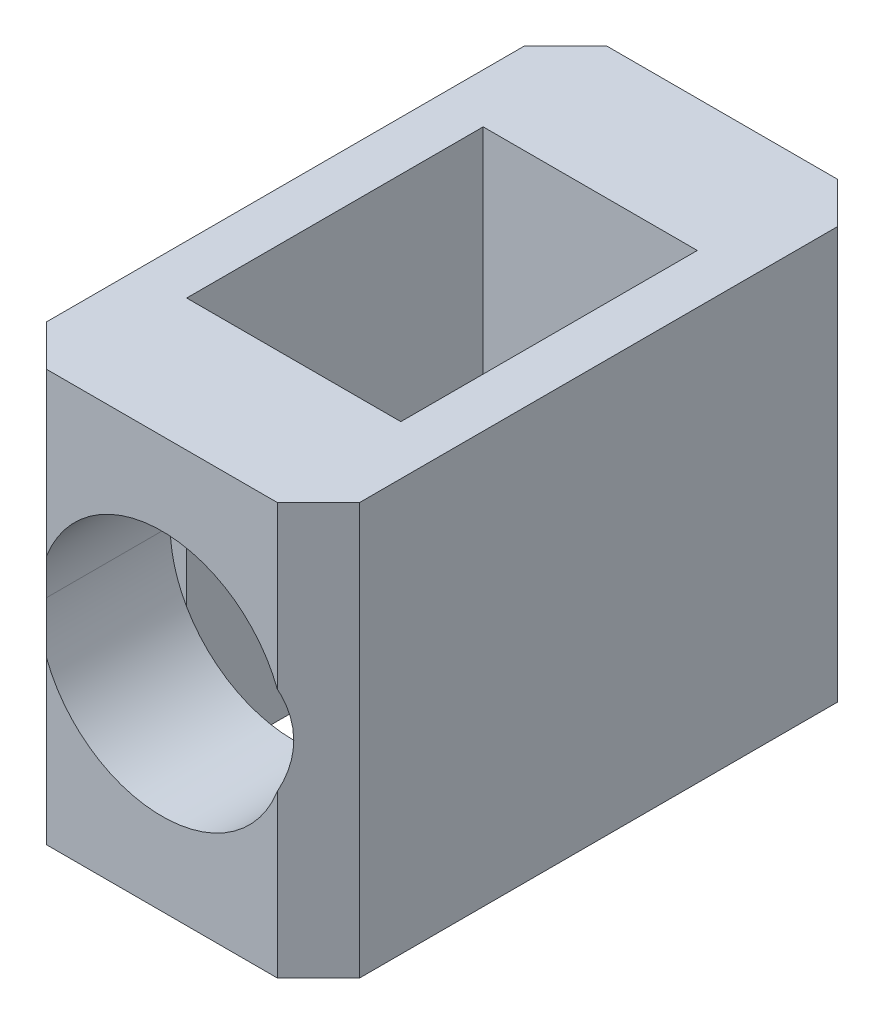
ISO-10303-21;
HEADER;
FILE_DESCRIPTION(('STEP AP214'),'2;1');
FILE_NAME('part.step','',(''),(''),'','','');
FILE_SCHEMA(('AUTOMOTIVE_DESIGN { 1 0 10303 214 1 1 1 1 }'));
ENDSEC;
DATA;
#1=APPLICATION_CONTEXT('core data for automotive mechanical design processes');
#2=APPLICATION_PROTOCOL_DEFINITION('international standard','automotive_design',2000,#1);
#3=PRODUCT_CONTEXT('',#1,'mechanical');
#4=PRODUCT('Part','Part','',(#3));
#5=PRODUCT_RELATED_PRODUCT_CATEGORY('part','',(#4));
#6=PRODUCT_DEFINITION_FORMATION('','',#4);
#7=PRODUCT_DEFINITION_CONTEXT('part definition',#1,'design');
#8=PRODUCT_DEFINITION('design','',#6,#7);
#9=PRODUCT_DEFINITION_SHAPE('','',#8);
#10=(LENGTH_UNIT() NAMED_UNIT(*) SI_UNIT(.MILLI.,.METRE.));
#11=(NAMED_UNIT(*) PLANE_ANGLE_UNIT() SI_UNIT($,.RADIAN.));
#12=(NAMED_UNIT(*) SI_UNIT($,.STERADIAN.) SOLID_ANGLE_UNIT());
#13=UNCERTAINTY_MEASURE_WITH_UNIT(LENGTH_MEASURE(1.E-05),#10,'distance_accuracy_value','');
#14=(GEOMETRIC_REPRESENTATION_CONTEXT(3) GLOBAL_UNCERTAINTY_ASSIGNED_CONTEXT((#13)) GLOBAL_UNIT_ASSIGNED_CONTEXT((#10,
#11,#12)) REPRESENTATION_CONTEXT('',''));
#15=CARTESIAN_POINT('',(0.,0.,0.));
#16=DIRECTION('',(0.,0.,1.));
#17=DIRECTION('',(1.,0.,0.));
#18=AXIS2_PLACEMENT_3D('',#15,#16,#17);
#19=CARTESIAN_POINT('',(2.53999999999975,5.27000000000021,8.43));
#20=DIRECTION('',(0.,0.,-1.));
#21=DIRECTION('',(-1.,0.,0.));
#22=AXIS2_PLACEMENT_3D('',#19,#20,#21);
#23=CYLINDRICAL_SURFACE('',#22,1.5);
#24=DIRECTION('',(0.,0.,1.));
#25=VECTOR('',#24,1.);
#26=CARTESIAN_POINT('',(1.04000000000035,5.26999999999963,8.43));
#27=LINE('',#26,#25);
#28=CARTESIAN_POINT('',(1.04000000000032,5.26999999999963,6.83));
#29=VERTEX_POINT('',#28);
#30=CARTESIAN_POINT('',(1.04000000000032,5.26999999999963,8.33));
#31=VERTEX_POINT('',#30);
#32=EDGE_CURVE('E250',#29,#31,#27,.T.);
#33=ORIENTED_EDGE('',*,*,#32,.F.);
#34=CARTESIAN_POINT('',(2.53999999999972,5.27000000000021,6.82999999999992));
#35=DIRECTION('',(0.,0.,1.));
#36=DIRECTION('',(-1.,0.,0.));
#37=AXIS2_PLACEMENT_3D('',#34,#35,#36);
#38=CIRCLE('',#37,1.5);
#39=CARTESIAN_POINT('',(1.24000000000002,6.01833147735468,6.83));
#40=VERTEX_POINT('',#39);
#41=EDGE_CURVE('E28',#40,#29,#38,.T.);
#42=ORIENTED_EDGE('',*,*,#41,.F.);
#43=CARTESIAN_POINT('',(2.53999999999972,5.27000000000021,6.83));
#44=DIRECTION('',(0.,0.,1.));
#45=DIRECTION('',(-1.,0.,0.));
#46=AXIS2_PLACEMENT_3D('',#43,#44,#45);
#47=CIRCLE('',#46,1.5);
#48=CARTESIAN_POINT('',(3.84000000000005,6.01833147735475,6.82999999999989));
#49=VERTEX_POINT('',#48);
#50=EDGE_CURVE('E304',#49,#40,#47,.T.);
#51=ORIENTED_EDGE('',*,*,#50,.F.);
#52=CARTESIAN_POINT('',(2.53999999999972,5.27000000000021,6.82999999999992));
#53=DIRECTION('',(0.,0.,1.));
#54=DIRECTION('',(-1.,0.,0.));
#55=AXIS2_PLACEMENT_3D('',#52,#53,#54);
#56=CIRCLE('',#55,1.5);
#57=CARTESIAN_POINT('',(4.03999999999983,5.27000000000007,6.82999999999989));
#58=VERTEX_POINT('',#57);
#59=EDGE_CURVE('E11',#58,#49,#56,.T.);
#60=ORIENTED_EDGE('',*,*,#59,.F.);
#61=DIRECTION('',(0.,0.,1.));
#62=VECTOR('',#61,1.);
#63=CARTESIAN_POINT('',(4.03999999999986,5.27000000000007,8.43));
#64=LINE('',#63,#62);
#65=CARTESIAN_POINT('',(4.03999999999983,5.27000000000007,8.32999999999989));
#66=VERTEX_POINT('',#65);
#67=EDGE_CURVE('E246',#58,#66,#64,.T.);
#68=ORIENTED_EDGE('',*,*,#67,.T.);
#69=CARTESIAN_POINT('',(2.53999999999975,5.27000000000021,9.83));
#70=DIRECTION('',(0.707106781186561,0.,0.707106781186534));
#71=DIRECTION('',(-0.707106781186534,0.,0.707106781186561));
#72=AXIS2_PLACEMENT_3D('',#69,#70,#71);
#73=ELLIPSE('',#72,2.12132034355964,1.5);
#74=CARTESIAN_POINT('',(3.93999999999981,5.80851648071365,8.43));
#75=VERTEX_POINT('',#74);
#76=EDGE_CURVE('E253',#66,#75,#73,.T.);
#77=ORIENTED_EDGE('',*,*,#76,.T.);
#78=CARTESIAN_POINT('',(2.53999999999975,5.27000000000021,8.43));
#79=DIRECTION('',(0.,0.,1.));
#80=DIRECTION('',(-1.,0.,0.));
#81=AXIS2_PLACEMENT_3D('',#78,#79,#80);
#82=CIRCLE('',#81,1.5);
#83=CARTESIAN_POINT('',(1.13999999999991,5.80851648071329,8.43));
#84=VERTEX_POINT('',#83);
#85=EDGE_CURVE('E299',#75,#84,#82,.T.);
#86=ORIENTED_EDGE('',*,*,#85,.T.);
#87=CARTESIAN_POINT('',(2.53999999999975,5.27000000000021,9.83));
#88=DIRECTION('',(-0.707106781186535,0.,0.70710678118656));
#89=DIRECTION('',(0.70710678118656,0.,0.707106781186535));
#90=AXIS2_PLACEMENT_3D('',#87,#88,#89);
#91=ELLIPSE('',#90,2.12132034355964,1.5);
#92=EDGE_CURVE('E21',#84,#31,#91,.T.);
#93=ORIENTED_EDGE('',*,*,#92,.T.);
#94=EDGE_LOOP('',(#33,#42,#51,#60,#68,#77,#86,#93));
#95=FACE_BOUND('',#94,.T.);
#96=ADVANCED_FACE('F17',(#95),#23,.F.);
#97=CARTESIAN_POINT('',(3.86500000000031,5.26999999999963,6.82999999999989));
#98=DIRECTION('',(0.,0.,1.));
#99=DIRECTION('',(1.,0.,0.));
#100=AXIS2_PLACEMENT_3D('',#97,#98,#99);
#101=PLANE('',#100);
#102=DIRECTION('',(0.,-1.,0.));
#103=VECTOR('',#102,1.);
#104=CARTESIAN_POINT('',(3.83999999999985,2.77000000000016,6.82999999999989));
#105=LINE('',#104,#103);
#106=CARTESIAN_POINT('',(3.84000000000005,4.52166852264494,6.82999999999989));
#107=VERTEX_POINT('',#106);
#108=EDGE_CURVE('E292',#49,#107,#105,.T.);
#109=ORIENTED_EDGE('',*,*,#108,.T.);
#110=CARTESIAN_POINT('',(2.53999999999972,5.27000000000021,6.82999999999992));
#111=DIRECTION('',(0.,0.,1.));
#112=DIRECTION('',(-1.,0.,0.));
#113=AXIS2_PLACEMENT_3D('',#110,#111,#112);
#114=CIRCLE('',#113,1.5);
#115=EDGE_CURVE('E249',#107,#58,#114,.T.);
#116=ORIENTED_EDGE('',*,*,#115,.T.);
#117=ORIENTED_EDGE('',*,*,#59,.T.);
#118=EDGE_LOOP('',(#109,#116,#117));
#119=FACE_BOUND('',#118,.T.);
#120=ADVANCED_FACE('F436',(#119),#101,.T.);
#121=CARTESIAN_POINT('',(3.86500000000031,5.26999999999963,6.82999999999989));
#122=DIRECTION('',(0.,0.,1.));
#123=DIRECTION('',(1.,0.,0.));
#124=AXIS2_PLACEMENT_3D('',#121,#122,#123);
#125=PLANE('',#124);
#126=CARTESIAN_POINT('',(2.53999999999972,5.27000000000021,6.82999999999992));
#127=DIRECTION('',(0.,0.,1.));
#128=DIRECTION('',(-1.,0.,0.));
#129=AXIS2_PLACEMENT_3D('',#126,#127,#128);
#130=CIRCLE('',#129,1.5);
#131=CARTESIAN_POINT('',(1.24000000000016,4.52166852264501,6.83));
#132=VERTEX_POINT('',#131);
#133=EDGE_CURVE('E235',#29,#132,#130,.T.);
#134=ORIENTED_EDGE('',*,*,#133,.T.);
#135=DIRECTION('',(0.,1.,0.));
#136=VECTOR('',#135,1.);
#137=CARTESIAN_POINT('',(1.23999999999988,2.77000000000016,6.83));
#138=LINE('',#137,#136);
#139=EDGE_CURVE('E262',#132,#40,#138,.T.);
#140=ORIENTED_EDGE('',*,*,#139,.T.);
#141=ORIENTED_EDGE('',*,*,#41,.T.);
#142=EDGE_LOOP('',(#134,#140,#141));
#143=FACE_BOUND('',#142,.T.);
#144=ADVANCED_FACE('F454',(#143),#125,.T.);
#145=CARTESIAN_POINT('',(2.53999999999975,5.27000000000021,8.43));
#146=DIRECTION('',(0.,0.,-1.));
#147=DIRECTION('',(-1.,0.,0.));
#148=AXIS2_PLACEMENT_3D('',#145,#146,#147);
#149=CYLINDRICAL_SURFACE('',#148,1.5);
#150=ORIENTED_EDGE('',*,*,#133,.F.);
#151=ORIENTED_EDGE('',*,*,#32,.T.);
#152=CARTESIAN_POINT('',(2.53999999999975,5.27000000000021,9.83));
#153=DIRECTION('',(-0.707106781186535,0.,0.70710678118656));
#154=DIRECTION('',(0.70710678118656,0.,0.707106781186535));
#155=AXIS2_PLACEMENT_3D('',#152,#153,#154);
#156=ELLIPSE('',#155,2.12132034355964,1.5);
#157=CARTESIAN_POINT('',(1.13999999999977,4.73148351928682,8.43));
#158=VERTEX_POINT('',#157);
#159=EDGE_CURVE('E163',#31,#158,#156,.T.);
#160=ORIENTED_EDGE('',*,*,#159,.T.);
#161=CARTESIAN_POINT('',(2.53999999999975,5.27000000000021,8.43));
#162=DIRECTION('',(0.,0.,1.));
#163=DIRECTION('',(-1.,0.,0.));
#164=AXIS2_PLACEMENT_3D('',#161,#162,#163);
#165=CIRCLE('',#164,1.5);
#166=CARTESIAN_POINT('',(3.94000000000015,4.73148351928624,8.43));
#167=VERTEX_POINT('',#166);
#168=EDGE_CURVE('E199',#158,#167,#165,.T.);
#169=ORIENTED_EDGE('',*,*,#168,.T.);
#170=CARTESIAN_POINT('',(2.53999999999975,5.27000000000021,9.83));
#171=DIRECTION('',(0.707106781186561,0.,0.707106781186534));
#172=DIRECTION('',(-0.707106781186534,0.,0.707106781186561));
#173=AXIS2_PLACEMENT_3D('',#170,#171,#172);
#174=ELLIPSE('',#173,2.12132034355964,1.5);
#175=EDGE_CURVE('E197',#167,#66,#174,.T.);
#176=ORIENTED_EDGE('',*,*,#175,.T.);
#177=ORIENTED_EDGE('',*,*,#67,.F.);
#178=ORIENTED_EDGE('',*,*,#115,.F.);
#179=CARTESIAN_POINT('',(2.53999999999972,5.27000000000021,6.83));
#180=DIRECTION('',(0.,0.,1.));
#181=DIRECTION('',(-1.,0.,0.));
#182=AXIS2_PLACEMENT_3D('',#179,#180,#181);
#183=CIRCLE('',#182,1.5);
#184=EDGE_CURVE('E231',#132,#107,#183,.T.);
#185=ORIENTED_EDGE('',*,*,#184,.F.);
#186=EDGE_LOOP('',(#150,#151,#160,#169,#176,#177,#178,#185));
#187=FACE_BOUND('',#186,.T.);
#188=ADVANCED_FACE('F452',(#187),#149,.F.);
#189=CARTESIAN_POINT('',(3.53999999999958,7.77000000000033,6.83));
#190=DIRECTION('',(0.,0.,1.));
#191=DIRECTION('',(1.,0.,0.));
#192=AXIS2_PLACEMENT_3D('',#189,#190,#191);
#193=PLANE('',#192);
#194=ORIENTED_EDGE('',*,*,#184,.T.);
#195=DIRECTION('',(0.,1.,0.));
#196=VECTOR('',#195,1.);
#197=CARTESIAN_POINT('',(3.83999999999985,2.77000000000016,6.83));
#198=LINE('',#197,#196);
#199=CARTESIAN_POINT('',(3.83999999999985,2.77000000000016,6.83));
#200=VERTEX_POINT('',#199);
#201=EDGE_CURVE('E223',#200,#107,#198,.T.);
#202=ORIENTED_EDGE('',*,*,#201,.F.);
#203=DIRECTION('',(1.,0.,0.));
#204=VECTOR('',#203,1.);
#205=CARTESIAN_POINT('',(60.4510968965142,2.7700000000002,6.82999999999898));
#206=LINE('',#205,#204);
#207=CARTESIAN_POINT('',(1.23999999999988,2.77000000000016,6.83));
#208=VERTEX_POINT('',#207);
#209=EDGE_CURVE('E317',#208,#200,#206,.T.);
#210=ORIENTED_EDGE('',*,*,#209,.F.);
#211=DIRECTION('',(0.,1.,0.));
#212=VECTOR('',#211,1.);
#213=CARTESIAN_POINT('',(1.23999999999988,2.77000000000016,6.83));
#214=LINE('',#213,#212);
#215=EDGE_CURVE('E258',#208,#132,#214,.T.);
#216=ORIENTED_EDGE('',*,*,#215,.T.);
#217=EDGE_LOOP('',(#194,#202,#210,#216));
#218=FACE_BOUND('',#217,.T.);
#219=ADVANCED_FACE('F448',(#218),#193,.F.);
#220=CARTESIAN_POINT('',(0.890000000000284,5.26999999999964,8.18));
#221=DIRECTION('',(-0.707106781186534,0.,0.707106781186561));
#222=DIRECTION('',(0.,1.,0.));
#223=AXIS2_PLACEMENT_3D('',#220,#221,#222);
#224=PLANE('',#223);
#225=DIRECTION('',(0.,1.,0.));
#226=VECTOR('',#225,1.);
#227=CARTESIAN_POINT('',(0.64,5.26999999999984,7.93));
#228=LINE('',#227,#226);
#229=CARTESIAN_POINT('',(0.639999999999773,2.77000000000016,7.93));
#230=VERTEX_POINT('',#229);
#231=CARTESIAN_POINT('',(0.640000000000284,7.76999999999961,7.93));
#232=VERTEX_POINT('',#231);
#233=EDGE_CURVE('E236',#230,#232,#228,.T.);
#234=ORIENTED_EDGE('',*,*,#233,.F.);
#235=DIRECTION('',(-0.70710678118656,0.,-0.707106781186535));
#236=VECTOR('',#235,1.);
#237=CARTESIAN_POINT('',(-62.080076808694,2.76999999999905,-54.7900768086914));
#238=LINE('',#237,#236);
#239=CARTESIAN_POINT('',(1.14000000000034,2.76999999999965,8.43));
#240=VERTEX_POINT('',#239);
#241=EDGE_CURVE('E183',#240,#230,#238,.T.);
#242=ORIENTED_EDGE('',*,*,#241,.F.);
#243=DIRECTION('',(0.,1.,0.));
#244=VECTOR('',#243,1.);
#245=CARTESIAN_POINT('',(1.13999999999983,5.27000000000006,8.43));
#246=LINE('',#245,#244);
#247=EDGE_CURVE('E190',#240,#158,#246,.T.);
#248=ORIENTED_EDGE('',*,*,#247,.T.);
#249=ORIENTED_EDGE('',*,*,#159,.F.);
#250=ORIENTED_EDGE('',*,*,#92,.F.);
#251=DIRECTION('',(0.,1.,0.));
#252=VECTOR('',#251,1.);
#253=CARTESIAN_POINT('',(1.13999999999983,5.27000000000006,8.43));
#254=LINE('',#253,#252);
#255=CARTESIAN_POINT('',(1.14000000000011,7.76999999999983,8.43));
#256=VERTEX_POINT('',#255);
#257=EDGE_CURVE('E184',#84,#256,#254,.T.);
#258=ORIENTED_EDGE('',*,*,#257,.T.);
#259=DIRECTION('',(-0.70710678118656,0.,-0.707106781186535));
#260=VECTOR('',#259,1.);
#261=CARTESIAN_POINT('',(-62.0800768086941,7.76999999999941,-54.7900768086914));
#262=LINE('',#261,#260);
#263=EDGE_CURVE('E267',#256,#232,#262,.T.);
#264=ORIENTED_EDGE('',*,*,#263,.T.);
#265=EDGE_LOOP('',(#234,#242,#248,#249,#250,#258,#264));
#266=FACE_BOUND('',#265,.T.);
#267=ADVANCED_FACE('F384',(#266),#224,.T.);
#268=CARTESIAN_POINT('',(4.18999999999987,5.27,8.18));
#269=DIRECTION('',(0.70710678118656,0.,0.707106781186535));
#270=DIRECTION('',(0.,-1.,0.));
#271=AXIS2_PLACEMENT_3D('',#268,#269,#270);
#272=PLANE('',#271);
#273=DIRECTION('',(0.,-1.,0.));
#274=VECTOR('',#273,1.);
#275=CARTESIAN_POINT('',(4.44000000000015,5.26999999999985,7.93));
#276=LINE('',#275,#274);
#277=CARTESIAN_POINT('',(4.43999999999967,7.77000000000023,7.93));
#278=VERTEX_POINT('',#277);
#279=CARTESIAN_POINT('',(4.43999999999987,2.77000000000009,7.93));
#280=VERTEX_POINT('',#279);
#281=EDGE_CURVE('E192',#278,#280,#276,.T.);
#282=ORIENTED_EDGE('',*,*,#281,.F.);
#283=DIRECTION('',(-0.707106781186534,0.,0.707106781186561));
#284=VECTOR('',#283,1.);
#285=CARTESIAN_POINT('',(67.1600768086914,7.77000000000049,-54.7900768086937));
#286=LINE('',#285,#284);
#287=CARTESIAN_POINT('',(3.93999999999987,7.77,8.43));
#288=VERTEX_POINT('',#287);
#289=EDGE_CURVE('E278',#278,#288,#286,.T.);
#290=ORIENTED_EDGE('',*,*,#289,.T.);
#291=DIRECTION('',(0.,-1.,0.));
#292=VECTOR('',#291,1.);
#293=CARTESIAN_POINT('',(3.94000000000035,5.26999999999964,8.43));
#294=LINE('',#293,#292);
#295=EDGE_CURVE('E303',#288,#75,#294,.T.);
#296=ORIENTED_EDGE('',*,*,#295,.T.);
#297=ORIENTED_EDGE('',*,*,#76,.F.);
#298=ORIENTED_EDGE('',*,*,#175,.F.);
#299=DIRECTION('',(0.,-1.,0.));
#300=VECTOR('',#299,1.);
#301=CARTESIAN_POINT('',(3.94000000000035,5.26999999999964,8.43));
#302=LINE('',#301,#300);
#303=CARTESIAN_POINT('',(3.9400000000001,2.76999999999987,8.43));
#304=VERTEX_POINT('',#303);
#305=EDGE_CURVE('E189',#167,#304,#302,.T.);
#306=ORIENTED_EDGE('',*,*,#305,.T.);
#307=DIRECTION('',(-0.707106781186534,0.,0.707106781186561));
#308=VECTOR('',#307,1.);
#309=CARTESIAN_POINT('',(67.1600768086915,2.77000000000048,-54.7900768086937));
#310=LINE('',#309,#308);
#311=EDGE_CURVE('E171',#280,#304,#310,.T.);
#312=ORIENTED_EDGE('',*,*,#311,.F.);
#313=EDGE_LOOP('',(#282,#290,#296,#297,#298,#306,#312));
#314=FACE_BOUND('',#313,.T.);
#315=ADVANCED_FACE('F194',(#314),#272,.T.);
#316=CARTESIAN_POINT('',(0.890000000000171,5.26999999999964,1.87999999999996));
#317=DIRECTION('',(-0.70710678118656,0.,-0.707106781186535));
#318=DIRECTION('',(-0.707106781186535,0.,0.70710678118656));
#319=AXIS2_PLACEMENT_3D('',#316,#317,#318);
#320=PLANE('',#319);
#321=DIRECTION('',(0.,-1.,0.));
#322=VECTOR('',#321,1.);
#323=CARTESIAN_POINT('',(0.639999999999915,5.26999999999984,2.12999999999996));
#324=LINE('',#323,#322);
#325=CARTESIAN_POINT('',(0.640000000000199,7.76999999999961,2.13000000000006));
#326=VERTEX_POINT('',#325);
#327=CARTESIAN_POINT('',(0.639999999999687,2.77000000000016,2.13000000000006));
#328=VERTEX_POINT('',#327);
#329=EDGE_CURVE('E214',#326,#328,#324,.T.);
#330=ORIENTED_EDGE('',*,*,#329,.F.);
#331=DIRECTION('',(0.707106781186534,0.,-0.707106781186561));
#332=VECTOR('',#331,1.);
#333=CARTESIAN_POINT('',(57.5600768086915,7.77000000000034,-54.7900768086936));
#334=LINE('',#333,#332);
#335=CARTESIAN_POINT('',(1.13999999999997,7.76999999999983,1.63000000000004));
#336=VERTEX_POINT('',#335);
#337=EDGE_CURVE('E263',#326,#336,#334,.T.);
#338=ORIENTED_EDGE('',*,*,#337,.T.);
#339=DIRECTION('',(0.,-1.,0.));
#340=VECTOR('',#339,1.);
#341=CARTESIAN_POINT('',(1.13999999999969,5.27000000000006,1.62999999999994));
#342=LINE('',#341,#340);
#343=CARTESIAN_POINT('',(1.1400000000002,2.76999999999965,1.63000000000004));
#344=VERTEX_POINT('',#343);
#345=EDGE_CURVE('E272',#336,#344,#342,.T.);
#346=ORIENTED_EDGE('',*,*,#345,.T.);
#347=DIRECTION('',(0.707106781186534,0.,-0.707106781186561));
#348=VECTOR('',#347,1.);
#349=CARTESIAN_POINT('',(57.5600768086917,2.77000000000019,-54.7900768086936));
#350=LINE('',#349,#348);
#351=EDGE_CURVE('E341',#328,#344,#350,.T.);
#352=ORIENTED_EDGE('',*,*,#351,.F.);
#353=EDGE_LOOP('',(#330,#338,#346,#352));
#354=FACE_BOUND('',#353,.T.);
#355=ADVANCED_FACE('F399',(#354),#320,.T.);
#356=CARTESIAN_POINT('',(4.18999999999976,5.27,1.87999999999989));
#357=DIRECTION('',(0.707106781186535,0.,-0.707106781186561));
#358=DIRECTION('',(0.,-1.,0.));
#359=AXIS2_PLACEMENT_3D('',#356,#357,#358);
#360=PLANE('',#359);
#361=DIRECTION('',(0.,-1.,0.));
#362=VECTOR('',#361,1.);
#363=CARTESIAN_POINT('',(3.94000000000021,5.26999999999964,1.6299999999999));
#364=LINE('',#363,#362);
#365=CARTESIAN_POINT('',(3.93999999999973,7.77,1.63));
#366=VERTEX_POINT('',#365);
#367=CARTESIAN_POINT('',(3.93999999999995,2.76999999999987,1.63));
#368=VERTEX_POINT('',#367);
#369=EDGE_CURVE('E225',#366,#368,#364,.T.);
#370=ORIENTED_EDGE('',*,*,#369,.F.);
#371=DIRECTION('',(0.70710678118656,0.,0.707106781186535));
#372=VECTOR('',#371,1.);
#373=CARTESIAN_POINT('',(-52.4800768086939,7.76999999999941,-54.7900768086916));
#374=LINE('',#373,#372);
#375=CARTESIAN_POINT('',(4.43999999999958,7.77000000000023,2.13));
#376=VERTEX_POINT('',#375);
#377=EDGE_CURVE('E275',#366,#376,#374,.T.);
#378=ORIENTED_EDGE('',*,*,#377,.T.);
#379=DIRECTION('',(0.,-1.,0.));
#380=VECTOR('',#379,1.);
#381=CARTESIAN_POINT('',(4.44000000000007,5.26999999999985,2.12999999999989));
#382=LINE('',#381,#380);
#383=CARTESIAN_POINT('',(4.43999999999978,2.77000000000009,2.13));
#384=VERTEX_POINT('',#383);
#385=EDGE_CURVE('E241',#376,#384,#382,.T.);
#386=ORIENTED_EDGE('',*,*,#385,.T.);
#387=DIRECTION('',(0.70710678118656,0.,0.707106781186535));
#388=VECTOR('',#387,1.);
#389=CARTESIAN_POINT('',(-52.4800768086939,2.76999999999905,-54.7900768086916));
#390=LINE('',#389,#388);
#391=EDGE_CURVE('E321',#368,#384,#390,.T.);
#392=ORIENTED_EDGE('',*,*,#391,.F.);
#393=EDGE_LOOP('',(#370,#378,#386,#392));
#394=FACE_BOUND('',#393,.T.);
#395=ADVANCED_FACE('F408',(#394),#360,.T.);
#396=CARTESIAN_POINT('',(60.4510968965131,2.77000000000019,-54.7900768086936));
#397=DIRECTION('',(0.,1.,0.));
#398=DIRECTION('',(1.,0.,0.));
#399=AXIS2_PLACEMENT_3D('',#396,#397,#398);
#400=PLANE('',#399);
#401=DIRECTION('',(0.,0.,1.));
#402=VECTOR('',#401,1.);
#403=CARTESIAN_POINT('',(1.23999999999877,2.77000000000015,-54.7900768086926));
#404=LINE('',#403,#402);
#405=CARTESIAN_POINT('',(1.2399999999998,2.77000000000016,3.22999999999994));
#406=VERTEX_POINT('',#405);
#407=EDGE_CURVE('E224',#406,#208,#404,.T.);
#408=ORIENTED_EDGE('',*,*,#407,.T.);
#409=ORIENTED_EDGE('',*,*,#209,.T.);
#410=DIRECTION('',(0.,0.,-1.));
#411=VECTOR('',#410,1.);
#412=CARTESIAN_POINT('',(3.83999999999874,2.77000000000015,-54.7900768086926));
#413=LINE('',#412,#411);
#414=CARTESIAN_POINT('',(3.83999999999976,2.77000000000016,3.22999999999989));
#415=VERTEX_POINT('',#414);
#416=EDGE_CURVE('E220',#200,#415,#413,.T.);
#417=ORIENTED_EDGE('',*,*,#416,.T.);
#418=DIRECTION('',(-1.,0.,0.));
#419=VECTOR('',#418,1.);
#420=CARTESIAN_POINT('',(60.4510968965141,2.7700000000002,3.22999999999887));
#421=LINE('',#420,#419);
#422=EDGE_CURVE('E279',#415,#406,#421,.T.);
#423=ORIENTED_EDGE('',*,*,#422,.T.);
#424=EDGE_LOOP('',(#408,#409,#417,#423));
#425=FACE_BOUND('',#424,.T.);
#426=DIRECTION('',(0.,0.,-1.));
#427=VECTOR('',#426,1.);
#428=CARTESIAN_POINT('',(4.43999999999876,2.77000000000008,-54.7900768086926));
#429=LINE('',#428,#427);
#430=EDGE_CURVE('E177',#280,#384,#429,.T.);
#431=ORIENTED_EDGE('',*,*,#430,.F.);
#432=ORIENTED_EDGE('',*,*,#311,.T.);
#433=DIRECTION('',(-1.,0.,0.));
#434=VECTOR('',#433,1.);
#435=CARTESIAN_POINT('',(60.4510968965142,2.7700000000002,8.42999999999897));
#436=LINE('',#435,#434);
#437=EDGE_CURVE('E174',#304,#240,#436,.T.);
#438=ORIENTED_EDGE('',*,*,#437,.T.);
#439=ORIENTED_EDGE('',*,*,#241,.T.);
#440=DIRECTION('',(0.,0.,-1.));
#441=VECTOR('',#440,1.);
#442=CARTESIAN_POINT('',(0.639999999998664,2.77000000000016,-54.7900768086925));
#443=LINE('',#442,#441);
#444=EDGE_CURVE('E218',#230,#328,#443,.T.);
#445=ORIENTED_EDGE('',*,*,#444,.T.);
#446=ORIENTED_EDGE('',*,*,#351,.T.);
#447=DIRECTION('',(-1.,0.,0.));
#448=VECTOR('',#447,1.);
#449=CARTESIAN_POINT('',(60.4510968965141,2.7700000000002,1.62999999999888));
#450=LINE('',#449,#448);
#451=EDGE_CURVE('E229',#368,#344,#450,.T.);
#452=ORIENTED_EDGE('',*,*,#451,.F.);
#453=ORIENTED_EDGE('',*,*,#391,.T.);
#454=EDGE_LOOP('',(#431,#432,#438,#439,#445,#446,#452,#453));
#455=FACE_BOUND('',#454,.T.);
#456=ADVANCED_FACE('F173',(#425,#455),#400,.F.);
#457=CARTESIAN_POINT('',(3.74000000000031,2.76999999999965,8.43));
#458=DIRECTION('',(0.,0.,1.));
#459=DIRECTION('',(1.,0.,0.));
#460=AXIS2_PLACEMENT_3D('',#457,#458,#459);
#461=PLANE('',#460);
#462=ORIENTED_EDGE('',*,*,#85,.F.);
#463=ORIENTED_EDGE('',*,*,#295,.F.);
#464=DIRECTION('',(-1.,0.,0.));
#465=VECTOR('',#464,1.);
#466=CARTESIAN_POINT('',(60.451096896514,7.77000000000035,8.42999999999897));
#467=LINE('',#466,#465);
#468=EDGE_CURVE('E311',#288,#256,#467,.T.);
#469=ORIENTED_EDGE('',*,*,#468,.T.);
#470=ORIENTED_EDGE('',*,*,#257,.F.);
#471=EDGE_LOOP('',(#462,#463,#469,#470));
#472=FACE_BOUND('',#471,.T.);
#473=ADVANCED_FACE('F390',(#472),#461,.T.);
#474=CARTESIAN_POINT('',(3.53999999999958,7.77000000000033,6.83));
#475=DIRECTION('',(0.,0.,1.));
#476=DIRECTION('',(1.,0.,0.));
#477=AXIS2_PLACEMENT_3D('',#474,#475,#476);
#478=PLANE('',#477);
#479=DIRECTION('',(0.,1.,0.));
#480=VECTOR('',#479,1.);
#481=CARTESIAN_POINT('',(3.83999999999985,2.77000000000016,6.83));
#482=LINE('',#481,#480);
#483=CARTESIAN_POINT('',(3.83999999999962,7.77000000000031,6.83));
#484=VERTEX_POINT('',#483);
#485=EDGE_CURVE('E209',#49,#484,#482,.T.);
#486=ORIENTED_EDGE('',*,*,#485,.F.);
#487=ORIENTED_EDGE('',*,*,#50,.T.);
#488=DIRECTION('',(0.,1.,0.));
#489=VECTOR('',#488,1.);
#490=CARTESIAN_POINT('',(1.23999999999988,2.77000000000016,6.83));
#491=LINE('',#490,#489);
#492=CARTESIAN_POINT('',(1.23999999999965,7.77000000000031,6.83));
#493=VERTEX_POINT('',#492);
#494=EDGE_CURVE('E288',#40,#493,#491,.T.);
#495=ORIENTED_EDGE('',*,*,#494,.T.);
#496=DIRECTION('',(1.,0.,0.));
#497=VECTOR('',#496,1.);
#498=CARTESIAN_POINT('',(60.4510968965139,7.77000000000035,6.82999999999898));
#499=LINE('',#498,#497);
#500=EDGE_CURVE('E230',#493,#484,#499,.T.);
#501=ORIENTED_EDGE('',*,*,#500,.T.);
#502=EDGE_LOOP('',(#486,#487,#495,#501));
#503=FACE_BOUND('',#502,.T.);
#504=ADVANCED_FACE('F441',(#503),#478,.F.);
#505=CARTESIAN_POINT('',(1.34,2.76999999999987,1.62999999999994));
#506=DIRECTION('',(0.,0.,-1.));
#507=DIRECTION('',(-1.,0.,0.));
#508=AXIS2_PLACEMENT_3D('',#505,#506,#507);
#509=PLANE('',#508);
#510=ORIENTED_EDGE('',*,*,#369,.T.);
#511=ORIENTED_EDGE('',*,*,#451,.T.);
#512=ORIENTED_EDGE('',*,*,#345,.F.);
#513=DIRECTION('',(-1.,0.,0.));
#514=VECTOR('',#513,1.);
#515=CARTESIAN_POINT('',(60.4510968965138,7.77000000000035,1.62999999999888));
#516=LINE('',#515,#514);
#517=EDGE_CURVE('E268',#366,#336,#516,.T.);
#518=ORIENTED_EDGE('',*,*,#517,.F.);
#519=EDGE_LOOP('',(#510,#511,#512,#518));
#520=FACE_BOUND('',#519,.T.);
#521=ADVANCED_FACE('F403',(#520),#509,.T.);
#522=CARTESIAN_POINT('',(1.53164106708944,7.76999999999981,7.62205114905214));
#523=DIRECTION('',(0.,1.,0.));
#524=DIRECTION('',(1.,0.,0.));
#525=AXIS2_PLACEMENT_3D('',#522,#523,#524);
#526=PLANE('',#525);
#527=DIRECTION('',(-1.,0.,0.));
#528=VECTOR('',#527,1.);
#529=CARTESIAN_POINT('',(60.4510968965139,7.77000000000035,3.22999999999887));
#530=LINE('',#529,#528);
#531=CARTESIAN_POINT('',(3.83999999999953,7.77000000000031,3.22999999999989));
#532=VERTEX_POINT('',#531);
#533=CARTESIAN_POINT('',(1.23999999999957,7.77000000000031,3.22999999999994));
#534=VERTEX_POINT('',#533);
#535=EDGE_CURVE('E240',#532,#534,#530,.T.);
#536=ORIENTED_EDGE('',*,*,#535,.F.);
#537=DIRECTION('',(0.,0.,-1.));
#538=VECTOR('',#537,1.);
#539=CARTESIAN_POINT('',(3.83999999999851,7.7700000000003,-54.7900768086926));
#540=LINE('',#539,#538);
#541=EDGE_CURVE('E200',#484,#532,#540,.T.);
#542=ORIENTED_EDGE('',*,*,#541,.F.);
#543=ORIENTED_EDGE('',*,*,#500,.F.);
#544=DIRECTION('',(0.,0.,1.));
#545=VECTOR('',#544,1.);
#546=CARTESIAN_POINT('',(1.23999999999854,7.7700000000003,-54.7900768086926));
#547=LINE('',#546,#545);
#548=EDGE_CURVE('E257',#534,#493,#547,.T.);
#549=ORIENTED_EDGE('',*,*,#548,.F.);
#550=EDGE_LOOP('',(#536,#542,#543,#549));
#551=FACE_BOUND('',#550,.T.);
#552=ORIENTED_EDGE('',*,*,#517,.T.);
#553=ORIENTED_EDGE('',*,*,#337,.F.);
#554=DIRECTION('',(0.,0.,-1.));
#555=VECTOR('',#554,1.);
#556=CARTESIAN_POINT('',(0.639999999999176,7.7699999999996,-54.7900768086925));
#557=LINE('',#556,#555);
#558=EDGE_CURVE('E219',#232,#326,#557,.T.);
#559=ORIENTED_EDGE('',*,*,#558,.F.);
#560=ORIENTED_EDGE('',*,*,#263,.F.);
#561=ORIENTED_EDGE('',*,*,#468,.F.);
#562=ORIENTED_EDGE('',*,*,#289,.F.);
#563=DIRECTION('',(0.,0.,-1.));
#564=VECTOR('',#563,1.);
#565=CARTESIAN_POINT('',(4.43999999999856,7.77000000000022,-54.7900768086926));
#566=LINE('',#565,#564);
#567=EDGE_CURVE('E245',#278,#376,#566,.T.);
#568=ORIENTED_EDGE('',*,*,#567,.T.);
#569=ORIENTED_EDGE('',*,*,#377,.F.);
#570=EDGE_LOOP('',(#552,#553,#559,#560,#561,#562,#568,#569));
#571=FACE_BOUND('',#570,.T.);
#572=ADVANCED_FACE('F392',(#551,#571),#526,.T.);
#573=CARTESIAN_POINT('',(4.43999999999978,2.77000000000009,2.33));
#574=DIRECTION('',(1.,0.,0.));
#575=DIRECTION('',(0.,0.,-1.));
#576=AXIS2_PLACEMENT_3D('',#573,#574,#575);
#577=PLANE('',#576);
#578=ORIENTED_EDGE('',*,*,#281,.T.);
#579=ORIENTED_EDGE('',*,*,#430,.T.);
#580=ORIENTED_EDGE('',*,*,#385,.F.);
#581=ORIENTED_EDGE('',*,*,#567,.F.);
#582=EDGE_LOOP('',(#578,#579,#580,#581));
#583=FACE_BOUND('',#582,.T.);
#584=ADVANCED_FACE('F413',(#583),#577,.T.);
#585=CARTESIAN_POINT('',(3.74000000000031,2.76999999999965,8.43));
#586=DIRECTION('',(0.,0.,1.));
#587=DIRECTION('',(1.,0.,0.));
#588=AXIS2_PLACEMENT_3D('',#585,#586,#587);
#589=PLANE('',#588);
#590=ORIENTED_EDGE('',*,*,#305,.F.);
#591=ORIENTED_EDGE('',*,*,#168,.F.);
#592=ORIENTED_EDGE('',*,*,#247,.F.);
#593=ORIENTED_EDGE('',*,*,#437,.F.);
#594=EDGE_LOOP('',(#590,#591,#592,#593));
#595=FACE_BOUND('',#594,.T.);
#596=ADVANCED_FACE('F19',(#595),#589,.T.);
#597=CARTESIAN_POINT('',(3.83999999999953,7.77000000000031,3.53));
#598=DIRECTION('',(1.,0.,0.));
#599=DIRECTION('',(0.,0.,-1.));
#600=AXIS2_PLACEMENT_3D('',#597,#598,#599);
#601=PLANE('',#600);
#602=DIRECTION('',(0.,1.,0.));
#603=VECTOR('',#602,1.);
#604=CARTESIAN_POINT('',(3.83999999999976,2.77000000000016,3.22999999999989));
#605=LINE('',#604,#603);
#606=EDGE_CURVE('E283',#415,#532,#605,.T.);
#607=ORIENTED_EDGE('',*,*,#606,.F.);
#608=ORIENTED_EDGE('',*,*,#416,.F.);
#609=ORIENTED_EDGE('',*,*,#201,.T.);
#610=ORIENTED_EDGE('',*,*,#108,.F.);
#611=ORIENTED_EDGE('',*,*,#485,.T.);
#612=ORIENTED_EDGE('',*,*,#541,.T.);
#613=EDGE_LOOP('',(#607,#608,#609,#610,#611,#612));
#614=FACE_BOUND('',#613,.T.);
#615=ADVANCED_FACE('F445',(#614),#601,.F.);
#616=CARTESIAN_POINT('',(1.23999999999957,7.77000000000031,3.53));
#617=DIRECTION('',(-1.,0.,0.));
#618=DIRECTION('',(0.,1.,0.));
#619=AXIS2_PLACEMENT_3D('',#616,#617,#618);
#620=PLANE('',#619);
#621=ORIENTED_EDGE('',*,*,#548,.T.);
#622=ORIENTED_EDGE('',*,*,#494,.F.);
#623=ORIENTED_EDGE('',*,*,#139,.F.);
#624=ORIENTED_EDGE('',*,*,#215,.F.);
#625=ORIENTED_EDGE('',*,*,#407,.F.);
#626=DIRECTION('',(0.,1.,0.));
#627=VECTOR('',#626,1.);
#628=CARTESIAN_POINT('',(1.2399999999998,2.77000000000016,3.22999999999994));
#629=LINE('',#628,#627);
#630=EDGE_CURVE('E284',#406,#534,#629,.T.);
#631=ORIENTED_EDGE('',*,*,#630,.T.);
#632=EDGE_LOOP('',(#621,#622,#623,#624,#625,#631));
#633=FACE_BOUND('',#632,.T.);
#634=ADVANCED_FACE('F661',(#633),#620,.F.);
#635=CARTESIAN_POINT('',(0.639999999999773,2.77000000000016,7.73));
#636=DIRECTION('',(-1.,0.,0.));
#637=DIRECTION('',(0.,1.,0.));
#638=AXIS2_PLACEMENT_3D('',#635,#636,#637);
#639=PLANE('',#638);
#640=ORIENTED_EDGE('',*,*,#233,.T.);
#641=ORIENTED_EDGE('',*,*,#558,.T.);
#642=ORIENTED_EDGE('',*,*,#329,.T.);
#643=ORIENTED_EDGE('',*,*,#444,.F.);
#644=EDGE_LOOP('',(#640,#641,#642,#643));
#645=FACE_BOUND('',#644,.T.);
#646=ADVANCED_FACE('F396',(#645),#639,.T.);
#647=CARTESIAN_POINT('',(1.53999999999955,7.77000000000026,3.22999999999994));
#648=DIRECTION('',(0.,0.,-1.));
#649=DIRECTION('',(-1.,0.,0.));
#650=AXIS2_PLACEMENT_3D('',#647,#648,#649);
#651=PLANE('',#650);
#652=ORIENTED_EDGE('',*,*,#630,.F.);
#653=ORIENTED_EDGE('',*,*,#422,.F.);
#654=ORIENTED_EDGE('',*,*,#606,.T.);
#655=ORIENTED_EDGE('',*,*,#535,.T.);
#656=EDGE_LOOP('',(#652,#653,#654,#655));
#657=FACE_BOUND('',#656,.T.);
#658=ADVANCED_FACE('F648',(#657),#651,.F.);
#659=CLOSED_SHELL('',(#96,#120,#144,#188,#219,#267,#315,#355,#395,#456,#473,#504,#521,#572,#584,
#596,#615,#634,#646,#658));
#660=MANIFOLD_SOLID_BREP('B1',#659);
#661=ADVANCED_BREP_SHAPE_REPRESENTATION('',(#18,#660),#14);
#662=SHAPE_DEFINITION_REPRESENTATION(#9,#661);
ENDSEC;
END-ISO-10303-21;
